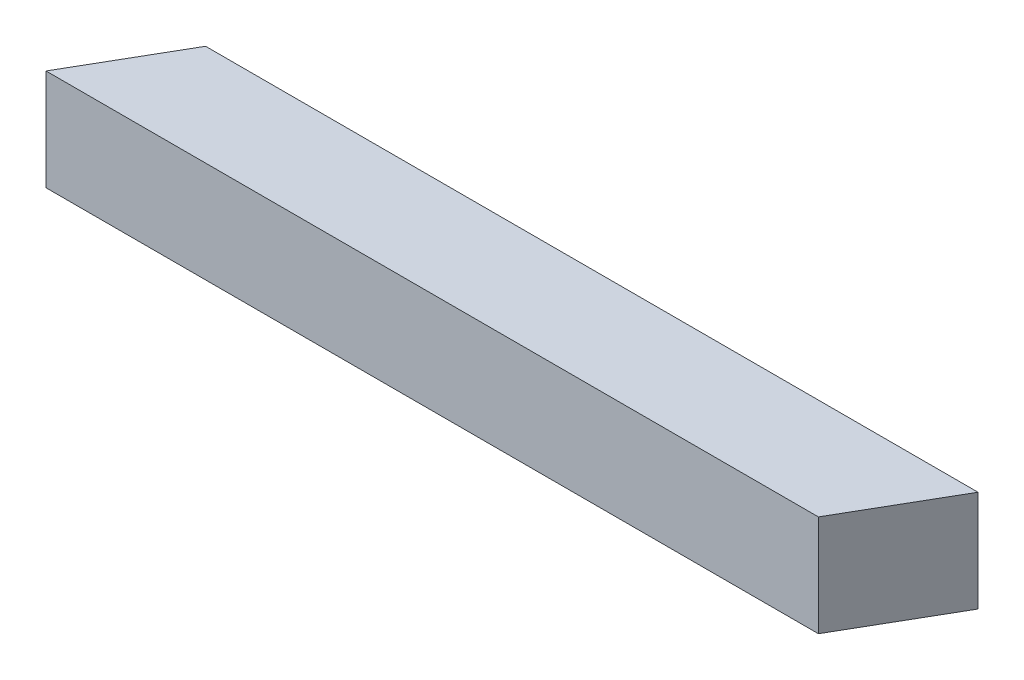
ISO-10303-21;
HEADER;
FILE_DESCRIPTION(('STEP AP214'),'2;1');
FILE_NAME('part.step','',(''),(''),'','','');
FILE_SCHEMA(('AUTOMOTIVE_DESIGN { 1 0 10303 214 1 1 1 1 }'));
ENDSEC;
DATA;
#1=APPLICATION_CONTEXT('core data for automotive mechanical design processes');
#2=APPLICATION_PROTOCOL_DEFINITION('international standard','automotive_design',2000,#1);
#3=PRODUCT_CONTEXT('',#1,'mechanical');
#4=PRODUCT('Part','Part','',(#3));
#5=PRODUCT_RELATED_PRODUCT_CATEGORY('part','',(#4));
#6=PRODUCT_DEFINITION_FORMATION('','',#4);
#7=PRODUCT_DEFINITION_CONTEXT('part definition',#1,'design');
#8=PRODUCT_DEFINITION('design','',#6,#7);
#9=PRODUCT_DEFINITION_SHAPE('','',#8);
#10=(LENGTH_UNIT() NAMED_UNIT(*) SI_UNIT(.MILLI.,.METRE.));
#11=(NAMED_UNIT(*) PLANE_ANGLE_UNIT() SI_UNIT($,.RADIAN.));
#12=(NAMED_UNIT(*) SI_UNIT($,.STERADIAN.) SOLID_ANGLE_UNIT());
#13=UNCERTAINTY_MEASURE_WITH_UNIT(LENGTH_MEASURE(1.E-05),#10,'distance_accuracy_value','');
#14=(GEOMETRIC_REPRESENTATION_CONTEXT(3) GLOBAL_UNCERTAINTY_ASSIGNED_CONTEXT((#13)) GLOBAL_UNIT_ASSIGNED_CONTEXT((#10,
#11,#12)) REPRESENTATION_CONTEXT('',''));
#15=CARTESIAN_POINT('',(0.,0.,0.));
#16=DIRECTION('',(0.,0.,1.));
#17=DIRECTION('',(1.,0.,0.));
#18=AXIS2_PLACEMENT_3D('',#15,#16,#17);
#19=CARTESIAN_POINT('',(0.,20.,10.));
#20=DIRECTION('',(0.,0.,-1.));
#21=DIRECTION('',(-1.,0.,0.));
#22=AXIS2_PLACEMENT_3D('',#19,#20,#21);
#23=PLANE('',#22);
#24=DIRECTION('',(1.,0.,0.));
#25=VECTOR('',#24,1.);
#26=CARTESIAN_POINT('',(0.,0.,10.));
#27=LINE('',#26,#25);
#28=CARTESIAN_POINT('',(-82.1135026918962,0.,9.99999999999999));
#29=VERTEX_POINT('',#28);
#30=CARTESIAN_POINT('',(70.5664973081037,0.,9.99999999999999));
#31=VERTEX_POINT('',#30);
#32=EDGE_CURVE('E72',#29,#31,#27,.T.);
#33=ORIENTED_EDGE('',*,*,#32,.T.);
#34=DIRECTION('',(0.,-1.,0.));
#35=VECTOR('',#34,1.);
#36=CARTESIAN_POINT('',(70.5664973081037,20.,9.99999999999999));
#37=LINE('',#36,#35);
#38=CARTESIAN_POINT('',(70.5664973081037,20.,9.99999999999999));
#39=VERTEX_POINT('',#38);
#40=EDGE_CURVE('E11',#39,#31,#37,.T.);
#41=ORIENTED_EDGE('',*,*,#40,.F.);
#42=DIRECTION('',(1.,0.,0.));
#43=VECTOR('',#42,1.);
#44=CARTESIAN_POINT('',(0.,20.,10.));
#45=LINE('',#44,#43);
#46=CARTESIAN_POINT('',(-82.1135026918962,20.,9.99999999999999));
#47=VERTEX_POINT('',#46);
#48=EDGE_CURVE('E77',#47,#39,#45,.T.);
#49=ORIENTED_EDGE('',*,*,#48,.F.);
#50=DIRECTION('',(0.,-1.,0.));
#51=VECTOR('',#50,1.);
#52=CARTESIAN_POINT('',(-82.1135026918962,20.,9.99999999999999));
#53=LINE('',#52,#51);
#54=EDGE_CURVE('E93',#47,#29,#53,.T.);
#55=ORIENTED_EDGE('',*,*,#54,.T.);
#56=EDGE_LOOP('',(#33,#41,#49,#55));
#57=FACE_BOUND('',#56,.T.);
#58=ADVANCED_FACE('F33',(#57),#23,.F.);
#59=CARTESIAN_POINT('',(70.5664973081037,20.,9.99999999999999));
#60=DIRECTION('',(-0.866025403784436,0.,-0.500000000000005));
#61=DIRECTION('',(-0.500000000000005,0.,0.866025403784436));
#62=AXIS2_PLACEMENT_3D('',#59,#60,#61);
#63=PLANE('',#62);
#64=DIRECTION('',(0.500000000000005,0.,-0.866025403784436));
#65=VECTOR('',#64,1.);
#66=CARTESIAN_POINT('',(70.5664973081037,0.,9.99999999999999));
#67=LINE('',#66,#65);
#68=CARTESIAN_POINT('',(82.1135026918964,0.,-9.99999999999999));
#69=VERTEX_POINT('',#68);
#70=EDGE_CURVE('E89',#31,#69,#67,.T.);
#71=ORIENTED_EDGE('',*,*,#70,.T.);
#72=DIRECTION('',(0.,-1.,0.));
#73=VECTOR('',#72,1.);
#74=CARTESIAN_POINT('',(82.1135026918964,20.,-9.99999999999999));
#75=LINE('',#74,#73);
#76=CARTESIAN_POINT('',(82.1135026918964,20.,-9.99999999999999));
#77=VERTEX_POINT('',#76);
#78=EDGE_CURVE('E41',#77,#69,#75,.T.);
#79=ORIENTED_EDGE('',*,*,#78,.F.);
#80=DIRECTION('',(0.500000000000005,0.,-0.866025403784436));
#81=VECTOR('',#80,1.);
#82=CARTESIAN_POINT('',(70.5664973081037,20.,9.99999999999999));
#83=LINE('',#82,#81);
#84=EDGE_CURVE('E80',#39,#77,#83,.T.);
#85=ORIENTED_EDGE('',*,*,#84,.F.);
#86=ORIENTED_EDGE('',*,*,#40,.T.);
#87=EDGE_LOOP('',(#71,#79,#85,#86));
#88=FACE_BOUND('',#87,.T.);
#89=ADVANCED_FACE('F88',(#88),#63,.F.);
#90=CARTESIAN_POINT('',(0.,20.,-9.99999999999999));
#91=DIRECTION('',(0.,0.,1.));
#92=DIRECTION('',(1.,0.,0.));
#93=AXIS2_PLACEMENT_3D('',#90,#91,#92);
#94=PLANE('',#93);
#95=DIRECTION('',(-1.,0.,0.));
#96=VECTOR('',#95,1.);
#97=CARTESIAN_POINT('',(0.,0.,-9.99999999999999));
#98=LINE('',#97,#96);
#99=CARTESIAN_POINT('',(-70.5664973081038,0.,-9.99999999999999));
#100=VERTEX_POINT('',#99);
#101=EDGE_CURVE('E65',#69,#100,#98,.T.);
#102=ORIENTED_EDGE('',*,*,#101,.T.);
#103=DIRECTION('',(0.,-1.,0.));
#104=VECTOR('',#103,1.);
#105=CARTESIAN_POINT('',(-70.5664973081038,20.,-9.99999999999999));
#106=LINE('',#105,#104);
#107=CARTESIAN_POINT('',(-70.5664973081038,20.,-9.99999999999999));
#108=VERTEX_POINT('',#107);
#109=EDGE_CURVE('E90',#108,#100,#106,.T.);
#110=ORIENTED_EDGE('',*,*,#109,.F.);
#111=DIRECTION('',(-1.,0.,0.));
#112=VECTOR('',#111,1.);
#113=CARTESIAN_POINT('',(82.1135026918964,20.,-9.99999999999999));
#114=LINE('',#113,#112);
#115=EDGE_CURVE('E84',#77,#108,#114,.T.);
#116=ORIENTED_EDGE('',*,*,#115,.F.);
#117=ORIENTED_EDGE('',*,*,#78,.T.);
#118=EDGE_LOOP('',(#102,#110,#116,#117));
#119=FACE_BOUND('',#118,.T.);
#120=ADVANCED_FACE('F91',(#119),#94,.F.);
#121=CARTESIAN_POINT('',(-70.5664973081038,20.,-9.99999999999999));
#122=DIRECTION('',(0.86602540378444,0.,0.499999999999998));
#123=DIRECTION('',(0.499999999999998,0.,-0.86602540378444));
#124=AXIS2_PLACEMENT_3D('',#121,#122,#123);
#125=PLANE('',#124);
#126=DIRECTION('',(-0.499999999999998,0.,0.86602540378444));
#127=VECTOR('',#126,1.);
#128=CARTESIAN_POINT('',(-70.5664973081038,0.,-9.99999999999999));
#129=LINE('',#128,#127);
#130=EDGE_CURVE('E100',#100,#29,#129,.T.);
#131=ORIENTED_EDGE('',*,*,#130,.T.);
#132=ORIENTED_EDGE('',*,*,#54,.F.);
#133=DIRECTION('',(-0.499999999999998,0.,0.86602540378444));
#134=VECTOR('',#133,1.);
#135=CARTESIAN_POINT('',(-70.5664973081038,20.,-9.99999999999999));
#136=LINE('',#135,#134);
#137=EDGE_CURVE('E49',#108,#47,#136,.T.);
#138=ORIENTED_EDGE('',*,*,#137,.F.);
#139=ORIENTED_EDGE('',*,*,#109,.T.);
#140=EDGE_LOOP('',(#131,#132,#138,#139));
#141=FACE_BOUND('',#140,.T.);
#142=ADVANCED_FACE('F105',(#141),#125,.F.);
#143=CARTESIAN_POINT('',(0.,20.,0.));
#144=DIRECTION('',(0.,1.,0.));
#145=DIRECTION('',(0.,0.,1.));
#146=AXIS2_PLACEMENT_3D('',#143,#144,#145);
#147=PLANE('',#146);
#148=ORIENTED_EDGE('',*,*,#48,.T.);
#149=ORIENTED_EDGE('',*,*,#84,.T.);
#150=ORIENTED_EDGE('',*,*,#115,.T.);
#151=ORIENTED_EDGE('',*,*,#137,.T.);
#152=EDGE_LOOP('',(#148,#149,#150,#151));
#153=FACE_BOUND('',#152,.T.);
#154=ADVANCED_FACE('F82',(#153),#147,.T.);
#155=CARTESIAN_POINT('',(0.,0.,0.));
#156=DIRECTION('',(0.,1.,0.));
#157=DIRECTION('',(0.,0.,1.));
#158=AXIS2_PLACEMENT_3D('',#155,#156,#157);
#159=PLANE('',#158);
#160=ORIENTED_EDGE('',*,*,#32,.F.);
#161=ORIENTED_EDGE('',*,*,#130,.F.);
#162=ORIENTED_EDGE('',*,*,#101,.F.);
#163=ORIENTED_EDGE('',*,*,#70,.F.);
#164=EDGE_LOOP('',(#160,#161,#162,#163));
#165=FACE_BOUND('',#164,.T.);
#166=ADVANCED_FACE('F106',(#165),#159,.F.);
#167=CLOSED_SHELL('',(#58,#89,#120,#142,#154,#166));
#168=MANIFOLD_SOLID_BREP('B2',#167);
#169=ADVANCED_BREP_SHAPE_REPRESENTATION('',(#18,#168),#14);
#170=SHAPE_DEFINITION_REPRESENTATION(#9,#169);
ENDSEC;
END-ISO-10303-21;
